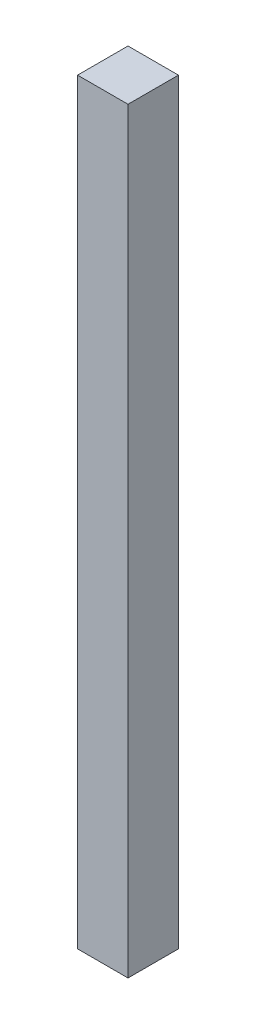
ISO-10303-21;
HEADER;
FILE_DESCRIPTION(('STEP AP214'),'2;1');
FILE_NAME('part.step','',(''),(''),'','','');
FILE_SCHEMA(('AUTOMOTIVE_DESIGN { 1 0 10303 214 1 1 1 1 }'));
ENDSEC;
DATA;
#1=APPLICATION_CONTEXT('core data for automotive mechanical design processes');
#2=APPLICATION_PROTOCOL_DEFINITION('international standard','automotive_design',2000,#1);
#3=PRODUCT_CONTEXT('',#1,'mechanical');
#4=PRODUCT('Part','Part','',(#3));
#5=PRODUCT_RELATED_PRODUCT_CATEGORY('part','',(#4));
#6=PRODUCT_DEFINITION_FORMATION('','',#4);
#7=PRODUCT_DEFINITION_CONTEXT('part definition',#1,'design');
#8=PRODUCT_DEFINITION('design','',#6,#7);
#9=PRODUCT_DEFINITION_SHAPE('','',#8);
#10=(LENGTH_UNIT() NAMED_UNIT(*) SI_UNIT(.MILLI.,.METRE.));
#11=(NAMED_UNIT(*) PLANE_ANGLE_UNIT() SI_UNIT($,.RADIAN.));
#12=(NAMED_UNIT(*) SI_UNIT($,.STERADIAN.) SOLID_ANGLE_UNIT());
#13=UNCERTAINTY_MEASURE_WITH_UNIT(LENGTH_MEASURE(1.E-05),#10,'distance_accuracy_value','');
#14=(GEOMETRIC_REPRESENTATION_CONTEXT(3) GLOBAL_UNCERTAINTY_ASSIGNED_CONTEXT((#13)) GLOBAL_UNIT_ASSIGNED_CONTEXT((#10,
#11,#12)) REPRESENTATION_CONTEXT('',''));
#15=CARTESIAN_POINT('',(0.,0.,0.));
#16=DIRECTION('',(0.,0.,1.));
#17=DIRECTION('',(1.,0.,0.));
#18=AXIS2_PLACEMENT_3D('',#15,#16,#17);
#19=CARTESIAN_POINT('',(0.,150.,0.));
#20=DIRECTION('',(1.,0.,0.));
#21=DIRECTION('',(0.,0.,-1.));
#22=AXIS2_PLACEMENT_3D('',#19,#20,#21);
#23=PLANE('',#22);
#24=DIRECTION('',(0.,0.,1.));
#25=VECTOR('',#24,1.);
#26=CARTESIAN_POINT('',(0.,0.,0.));
#27=LINE('',#26,#25);
#28=CARTESIAN_POINT('',(0.,0.,-10.));
#29=VERTEX_POINT('',#28);
#30=CARTESIAN_POINT('',(0.,0.,0.));
#31=VERTEX_POINT('',#30);
#32=EDGE_CURVE('E100',#29,#31,#27,.T.);
#33=ORIENTED_EDGE('',*,*,#32,.T.);
#34=DIRECTION('',(0.,-1.,0.));
#35=VECTOR('',#34,1.);
#36=CARTESIAN_POINT('',(0.,150.,0.));
#37=LINE('',#36,#35);
#38=CARTESIAN_POINT('',(0.,150.,0.));
#39=VERTEX_POINT('',#38);
#40=EDGE_CURVE('E11',#39,#31,#37,.T.);
#41=ORIENTED_EDGE('',*,*,#40,.F.);
#42=DIRECTION('',(0.,0.,1.));
#43=VECTOR('',#42,1.);
#44=CARTESIAN_POINT('',(0.,150.,0.));
#45=LINE('',#44,#43);
#46=CARTESIAN_POINT('',(0.,150.,-10.));
#47=VERTEX_POINT('',#46);
#48=EDGE_CURVE('E88',#47,#39,#45,.T.);
#49=ORIENTED_EDGE('',*,*,#48,.F.);
#50=DIRECTION('',(0.,-1.,0.));
#51=VECTOR('',#50,1.);
#52=CARTESIAN_POINT('',(0.,150.,-10.));
#53=LINE('',#52,#51);
#54=EDGE_CURVE('E96',#47,#29,#53,.T.);
#55=ORIENTED_EDGE('',*,*,#54,.T.);
#56=EDGE_LOOP('',(#33,#41,#49,#55));
#57=FACE_BOUND('',#56,.T.);
#58=ADVANCED_FACE('F37',(#57),#23,.F.);
#59=CARTESIAN_POINT('',(0.,150.,0.));
#60=DIRECTION('',(0.,0.,-1.));
#61=DIRECTION('',(-1.,0.,0.));
#62=AXIS2_PLACEMENT_3D('',#59,#60,#61);
#63=PLANE('',#62);
#64=DIRECTION('',(1.,0.,0.));
#65=VECTOR('',#64,1.);
#66=CARTESIAN_POINT('',(0.,0.,0.));
#67=LINE('',#66,#65);
#68=CARTESIAN_POINT('',(10.,0.,0.));
#69=VERTEX_POINT('',#68);
#70=EDGE_CURVE('E92',#31,#69,#67,.T.);
#71=ORIENTED_EDGE('',*,*,#70,.T.);
#72=DIRECTION('',(0.,-1.,0.));
#73=VECTOR('',#72,1.);
#74=CARTESIAN_POINT('',(10.,150.,0.));
#75=LINE('',#74,#73);
#76=CARTESIAN_POINT('',(10.,150.,0.));
#77=VERTEX_POINT('',#76);
#78=EDGE_CURVE('E45',#77,#69,#75,.T.);
#79=ORIENTED_EDGE('',*,*,#78,.F.);
#80=DIRECTION('',(1.,0.,0.));
#81=VECTOR('',#80,1.);
#82=CARTESIAN_POINT('',(0.,150.,0.));
#83=LINE('',#82,#81);
#84=EDGE_CURVE('E83',#39,#77,#83,.T.);
#85=ORIENTED_EDGE('',*,*,#84,.F.);
#86=ORIENTED_EDGE('',*,*,#40,.T.);
#87=EDGE_LOOP('',(#71,#79,#85,#86));
#88=FACE_BOUND('',#87,.T.);
#89=ADVANCED_FACE('F91',(#88),#63,.F.);
#90=CARTESIAN_POINT('',(10.,150.,0.));
#91=DIRECTION('',(-1.,0.,0.));
#92=DIRECTION('',(0.,0.,1.));
#93=AXIS2_PLACEMENT_3D('',#90,#91,#92);
#94=PLANE('',#93);
#95=DIRECTION('',(0.,0.,-1.));
#96=VECTOR('',#95,1.);
#97=CARTESIAN_POINT('',(10.,0.,0.));
#98=LINE('',#97,#96);
#99=CARTESIAN_POINT('',(10.,0.,-10.));
#100=VERTEX_POINT('',#99);
#101=EDGE_CURVE('E70',#69,#100,#98,.T.);
#102=ORIENTED_EDGE('',*,*,#101,.T.);
#103=DIRECTION('',(0.,-1.,0.));
#104=VECTOR('',#103,1.);
#105=CARTESIAN_POINT('',(10.,150.,-10.));
#106=LINE('',#105,#104);
#107=CARTESIAN_POINT('',(10.,150.,-10.));
#108=VERTEX_POINT('',#107);
#109=EDGE_CURVE('E93',#108,#100,#106,.T.);
#110=ORIENTED_EDGE('',*,*,#109,.F.);
#111=DIRECTION('',(0.,0.,-1.));
#112=VECTOR('',#111,1.);
#113=CARTESIAN_POINT('',(10.,150.,0.));
#114=LINE('',#113,#112);
#115=EDGE_CURVE('E86',#77,#108,#114,.T.);
#116=ORIENTED_EDGE('',*,*,#115,.F.);
#117=ORIENTED_EDGE('',*,*,#78,.T.);
#118=EDGE_LOOP('',(#102,#110,#116,#117));
#119=FACE_BOUND('',#118,.T.);
#120=ADVANCED_FACE('F94',(#119),#94,.F.);
#121=CARTESIAN_POINT('',(0.,150.,-10.));
#122=DIRECTION('',(0.,0.,1.));
#123=DIRECTION('',(1.,0.,0.));
#124=AXIS2_PLACEMENT_3D('',#121,#122,#123);
#125=PLANE('',#124);
#126=DIRECTION('',(-1.,0.,0.));
#127=VECTOR('',#126,1.);
#128=CARTESIAN_POINT('',(0.,0.,-10.));
#129=LINE('',#128,#127);
#130=EDGE_CURVE('E76',#100,#29,#129,.T.);
#131=ORIENTED_EDGE('',*,*,#130,.T.);
#132=ORIENTED_EDGE('',*,*,#54,.F.);
#133=DIRECTION('',(-1.,0.,0.));
#134=VECTOR('',#133,1.);
#135=CARTESIAN_POINT('',(0.,150.,-10.));
#136=LINE('',#135,#134);
#137=EDGE_CURVE('E53',#108,#47,#136,.T.);
#138=ORIENTED_EDGE('',*,*,#137,.F.);
#139=ORIENTED_EDGE('',*,*,#109,.T.);
#140=EDGE_LOOP('',(#131,#132,#138,#139));
#141=FACE_BOUND('',#140,.T.);
#142=ADVANCED_FACE('F107',(#141),#125,.F.);
#143=CARTESIAN_POINT('',(0.,150.,0.));
#144=DIRECTION('',(0.,-1.,0.));
#145=DIRECTION('',(0.,0.,-1.));
#146=AXIS2_PLACEMENT_3D('',#143,#144,#145);
#147=PLANE('',#146);
#148=ORIENTED_EDGE('',*,*,#48,.T.);
#149=ORIENTED_EDGE('',*,*,#84,.T.);
#150=ORIENTED_EDGE('',*,*,#115,.T.);
#151=ORIENTED_EDGE('',*,*,#137,.T.);
#152=EDGE_LOOP('',(#148,#149,#150,#151));
#153=FACE_BOUND('',#152,.T.);
#154=ADVANCED_FACE('F84',(#153),#147,.F.);
#155=CARTESIAN_POINT('',(0.,0.,0.));
#156=DIRECTION('',(0.,-1.,0.));
#157=DIRECTION('',(0.,0.,-1.));
#158=AXIS2_PLACEMENT_3D('',#155,#156,#157);
#159=PLANE('',#158);
#160=ORIENTED_EDGE('',*,*,#32,.F.);
#161=ORIENTED_EDGE('',*,*,#130,.F.);
#162=ORIENTED_EDGE('',*,*,#101,.F.);
#163=ORIENTED_EDGE('',*,*,#70,.F.);
#164=EDGE_LOOP('',(#160,#161,#162,#163));
#165=FACE_BOUND('',#164,.T.);
#166=ADVANCED_FACE('F110',(#165),#159,.T.);
#167=CLOSED_SHELL('',(#58,#89,#120,#142,#154,#166));
#168=MANIFOLD_SOLID_BREP('B2',#167);
#169=ADVANCED_BREP_SHAPE_REPRESENTATION('',(#18,#168),#14);
#170=SHAPE_DEFINITION_REPRESENTATION(#9,#169);
ENDSEC;
END-ISO-10303-21;
